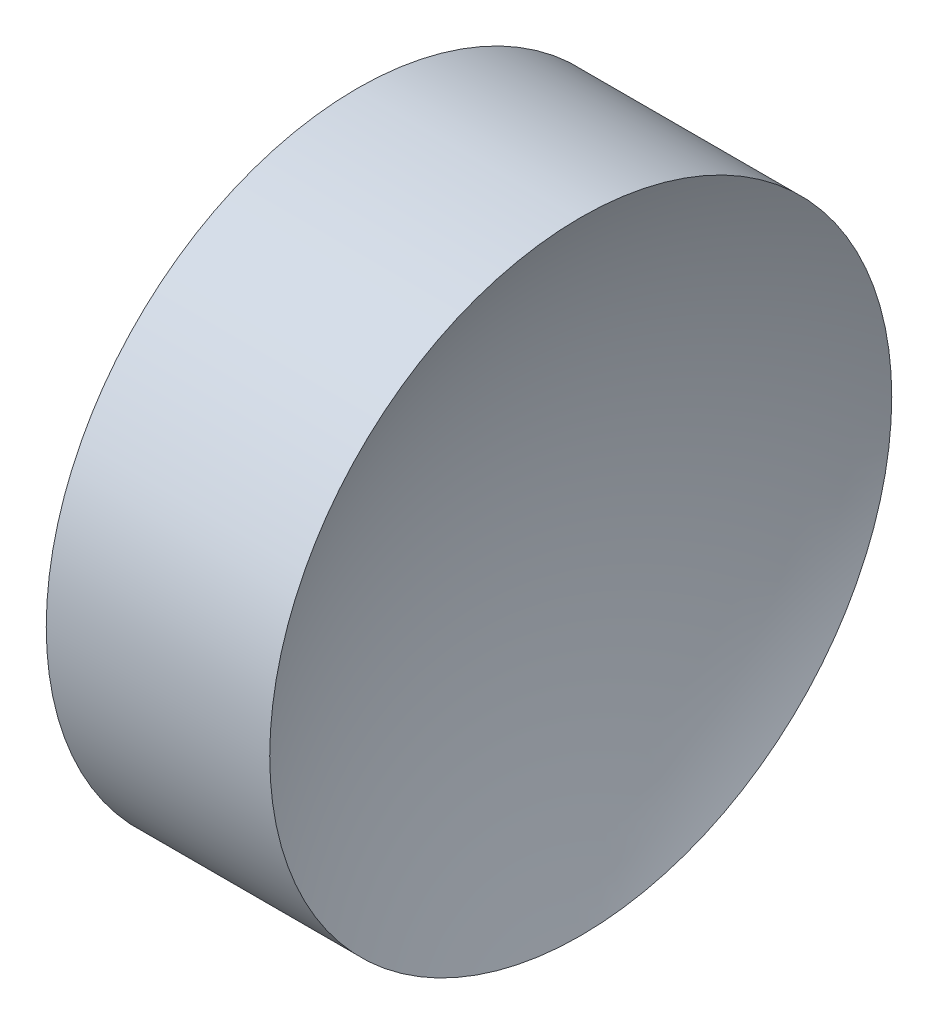
ISO-10303-21;
HEADER;
FILE_DESCRIPTION(('STEP AP214'),'2;1');
FILE_NAME('part.step','',(''),(''),'','','');
FILE_SCHEMA(('AUTOMOTIVE_DESIGN { 1 0 10303 214 1 1 1 1 }'));
ENDSEC;
DATA;
#1=APPLICATION_CONTEXT('core data for automotive mechanical design processes');
#2=APPLICATION_PROTOCOL_DEFINITION('international standard','automotive_design',2000,#1);
#3=PRODUCT_CONTEXT('',#1,'mechanical');
#4=PRODUCT('Part','Part','',(#3));
#5=PRODUCT_RELATED_PRODUCT_CATEGORY('part','',(#4));
#6=PRODUCT_DEFINITION_FORMATION('','',#4);
#7=PRODUCT_DEFINITION_CONTEXT('part definition',#1,'design');
#8=PRODUCT_DEFINITION('design','',#6,#7);
#9=PRODUCT_DEFINITION_SHAPE('','',#8);
#10=(LENGTH_UNIT() NAMED_UNIT(*) SI_UNIT(.MILLI.,.METRE.));
#11=(NAMED_UNIT(*) PLANE_ANGLE_UNIT() SI_UNIT($,.RADIAN.));
#12=(NAMED_UNIT(*) SI_UNIT($,.STERADIAN.) SOLID_ANGLE_UNIT());
#13=UNCERTAINTY_MEASURE_WITH_UNIT(LENGTH_MEASURE(1.E-05),#10,'distance_accuracy_value','');
#14=(GEOMETRIC_REPRESENTATION_CONTEXT(3) GLOBAL_UNCERTAINTY_ASSIGNED_CONTEXT((#13)) GLOBAL_UNIT_ASSIGNED_CONTEXT((#10,
#11,#12)) REPRESENTATION_CONTEXT('',''));
#15=CARTESIAN_POINT('',(0.,0.,0.));
#16=DIRECTION('',(0.,0.,1.));
#17=DIRECTION('',(1.,0.,0.));
#18=AXIS2_PLACEMENT_3D('',#15,#16,#17);
#19=CARTESIAN_POINT('',(30.5808805225643,13.031126091403,0.));
#20=DIRECTION('',(-1.,0.,0.));
#21=DIRECTION('',(0.,-1.,0.));
#22=AXIS2_PLACEMENT_3D('',#19,#20,#21);
#23=SPHERICAL_SURFACE('',#22,6.88);
#24=CARTESIAN_POINT('',(24.4643537303399,13.031126091403,0.));
#25=DIRECTION('',(-1.,0.,0.));
#26=DIRECTION('',(0.,0.,1.));
#27=AXIS2_PLACEMENT_3D('',#24,#25,#26);
#28=CIRCLE('',#27,3.15);
#29=CARTESIAN_POINT('',(24.4643537303399,13.031126091403,3.15));
#30=VERTEX_POINT('',#29);
#31=EDGE_CURVE('E10',#30,#30,#28,.T.);
#32=ORIENTED_EDGE('',*,*,#31,.F.);
#33=EDGE_LOOP('',(#32));
#34=FACE_BOUND('',#33,.T.);
#35=ADVANCED_FACE('F35',(#34),#23,.F.);
#36=CARTESIAN_POINT('',(21.1564719224443,13.031126091403,0.));
#37=DIRECTION('',(-1.,0.,0.));
#38=DIRECTION('',(0.,0.,1.));
#39=AXIS2_PLACEMENT_3D('',#36,#37,#38);
#40=CYLINDRICAL_SURFACE('',#39,3.15);
#41=CARTESIAN_POINT('',(22.2008754892866,13.031126091403,0.));
#42=DIRECTION('',(-1.,0.,0.));
#43=DIRECTION('',(0.,0.,1.));
#44=AXIS2_PLACEMENT_3D('',#41,#42,#43);
#45=CIRCLE('',#44,3.15);
#46=CARTESIAN_POINT('',(22.2008754892866,13.031126091403,3.15));
#47=VERTEX_POINT('',#46);
#48=EDGE_CURVE('E41',#47,#47,#45,.T.);
#49=ORIENTED_EDGE('',*,*,#48,.F.);
#50=EDGE_LOOP('',(#49));
#51=FACE_BOUND('',#50,.T.);
#52=ORIENTED_EDGE('',*,*,#31,.T.);
#53=EDGE_LOOP('',(#52));
#54=FACE_BOUND('',#53,.T.);
#55=ADVANCED_FACE('F49',(#51,#54),#40,.T.);
#56=CARTESIAN_POINT('',(22.2008754892866,13.031126091403,0.));
#57=DIRECTION('',(1.,0.,0.));
#58=DIRECTION('',(0.,0.,-1.));
#59=AXIS2_PLACEMENT_3D('',#56,#57,#58);
#60=PLANE('',#59);
#61=ORIENTED_EDGE('',*,*,#48,.T.);
#62=EDGE_LOOP('',(#61));
#63=FACE_BOUND('',#62,.T.);
#64=ADVANCED_FACE('F47',(#63),#60,.F.);
#65=CLOSED_SHELL('',(#35,#55,#64));
#66=MANIFOLD_SOLID_BREP('B2',#65);
#67=ADVANCED_BREP_SHAPE_REPRESENTATION('',(#18,#66),#14);
#68=SHAPE_DEFINITION_REPRESENTATION(#9,#67);
ENDSEC;
END-ISO-10303-21;
